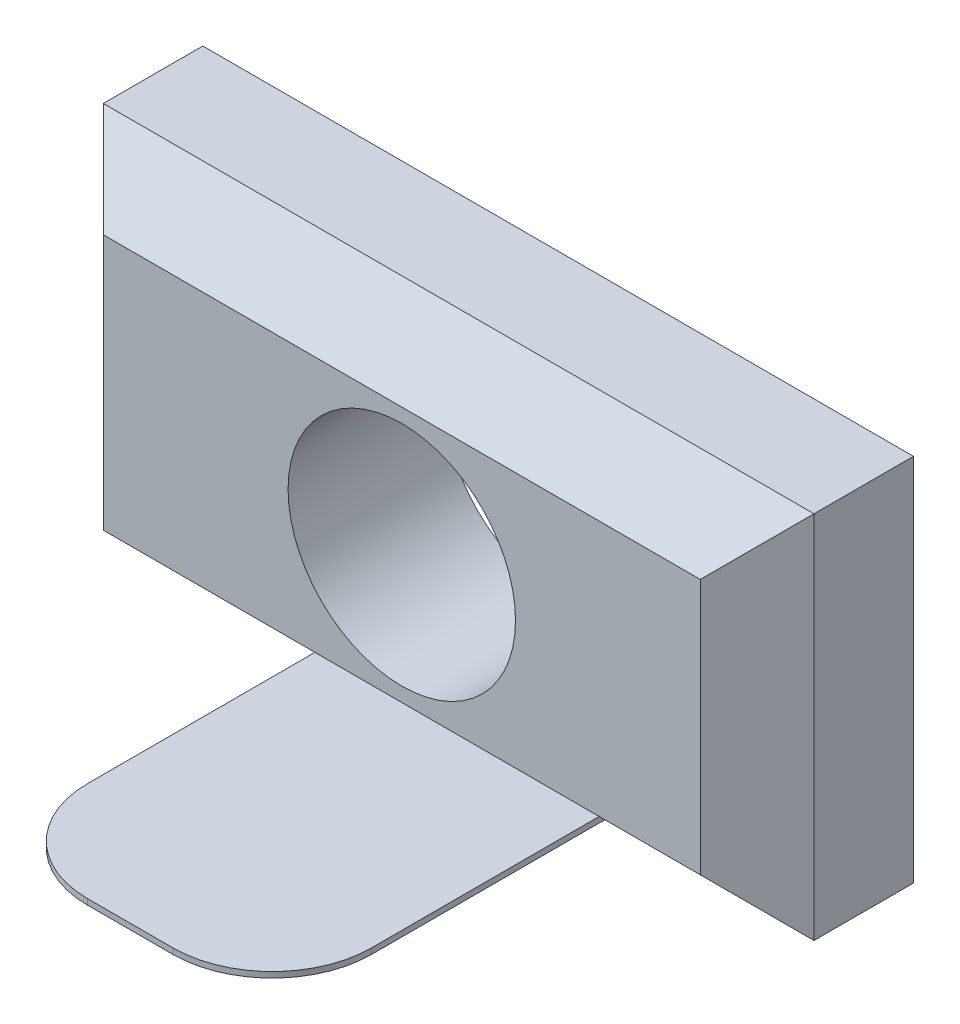
ISO-10303-21;
HEADER;
FILE_DESCRIPTION(('STEP AP214'),'2;1');
FILE_NAME('part.step','',(''),(''),'','','');
FILE_SCHEMA(('AUTOMOTIVE_DESIGN { 1 0 10303 214 1 1 1 1 }'));
ENDSEC;
DATA;
#1=APPLICATION_CONTEXT('core data for automotive mechanical design processes');
#2=APPLICATION_PROTOCOL_DEFINITION('international standard','automotive_design',2000,#1);
#3=PRODUCT_CONTEXT('',#1,'mechanical');
#4=PRODUCT('Part','Part','',(#3));
#5=PRODUCT_RELATED_PRODUCT_CATEGORY('part','',(#4));
#6=PRODUCT_DEFINITION_FORMATION('','',#4);
#7=PRODUCT_DEFINITION_CONTEXT('part definition',#1,'design');
#8=PRODUCT_DEFINITION('design','',#6,#7);
#9=PRODUCT_DEFINITION_SHAPE('','',#8);
#10=(LENGTH_UNIT() NAMED_UNIT(*) SI_UNIT(.MILLI.,.METRE.));
#11=(NAMED_UNIT(*) PLANE_ANGLE_UNIT() SI_UNIT($,.RADIAN.));
#12=(NAMED_UNIT(*) SI_UNIT($,.STERADIAN.) SOLID_ANGLE_UNIT());
#13=UNCERTAINTY_MEASURE_WITH_UNIT(LENGTH_MEASURE(1.E-05),#10,'distance_accuracy_value','');
#14=(GEOMETRIC_REPRESENTATION_CONTEXT(3) GLOBAL_UNCERTAINTY_ASSIGNED_CONTEXT((#13)) GLOBAL_UNIT_ASSIGNED_CONTEXT((#10,
#11,#12)) REPRESENTATION_CONTEXT('',''));
#15=CARTESIAN_POINT('',(0.,0.,0.));
#16=DIRECTION('',(0.,0.,1.));
#17=DIRECTION('',(1.,0.,0.));
#18=AXIS2_PLACEMENT_3D('',#15,#16,#17);
#19=CARTESIAN_POINT('',(-0.056548596713961,-6.5,6.97247170936017));
#20=DIRECTION('',(0.,1.,0.));
#21=DIRECTION('',(0.,0.,1.));
#22=AXIS2_PLACEMENT_3D('',#19,#20,#21);
#23=PLANE('',#22);
#24=DIRECTION('',(0.,0.,-1.));
#25=VECTOR('',#24,1.);
#26=CARTESIAN_POINT('',(4.94345140328603,-6.5,11.5));
#27=LINE('',#26,#25);
#28=CARTESIAN_POINT('',(4.94345140328604,-6.5,3.5));
#29=VERTEX_POINT('',#28);
#30=CARTESIAN_POINT('',(4.94345140328603,-6.5,11.5));
#31=VERTEX_POINT('',#30);
#32=EDGE_CURVE('E148',#29,#31,#27,.F.);
#33=ORIENTED_EDGE('',*,*,#32,.F.);
#34=DIRECTION('',(1.,0.,0.));
#35=VECTOR('',#34,1.);
#36=CARTESIAN_POINT('',(6.25,-6.5,3.5));
#37=LINE('',#36,#35);
#38=CARTESIAN_POINT('',(-5.05654859671396,-6.5,3.5));
#39=VERTEX_POINT('',#38);
#40=EDGE_CURVE('E151',#39,#29,#37,.T.);
#41=ORIENTED_EDGE('',*,*,#40,.F.);
#42=DIRECTION('',(0.,0.,1.));
#43=VECTOR('',#42,1.);
#44=CARTESIAN_POINT('',(-5.05654859671396,-6.5,0.));
#45=LINE('',#44,#43);
#46=CARTESIAN_POINT('',(-5.05654859671396,-6.5,11.5));
#47=VERTEX_POINT('',#46);
#48=EDGE_CURVE('E122',#47,#39,#45,.F.);
#49=ORIENTED_EDGE('',*,*,#48,.F.);
#50=CARTESIAN_POINT('',(-1.55654859671396,-6.5,11.5));
#51=DIRECTION('',(0.,-1.,0.));
#52=DIRECTION('',(0.,0.,-1.));
#53=AXIS2_PLACEMENT_3D('',#50,#51,#52);
#54=CIRCLE('',#53,3.5);
#55=CARTESIAN_POINT('',(-1.55654859671396,-6.5,15.));
#56=VERTEX_POINT('',#55);
#57=EDGE_CURVE('E17',#56,#47,#54,.T.);
#58=ORIENTED_EDGE('',*,*,#57,.F.);
#59=DIRECTION('',(1.,0.,0.));
#60=VECTOR('',#59,1.);
#61=CARTESIAN_POINT('',(-1.55654859671396,-6.5,15.));
#62=LINE('',#61,#60);
#63=CARTESIAN_POINT('',(1.44345140328604,-6.5,15.));
#64=VERTEX_POINT('',#63);
#65=EDGE_CURVE('E107',#64,#56,#62,.F.);
#66=ORIENTED_EDGE('',*,*,#65,.F.);
#67=CARTESIAN_POINT('',(1.44345140328603,-6.5,11.5));
#68=DIRECTION('',(0.,-1.,0.));
#69=DIRECTION('',(0.,0.,-1.));
#70=AXIS2_PLACEMENT_3D('',#67,#68,#69);
#71=CIRCLE('',#70,3.5);
#72=EDGE_CURVE('E129',#31,#64,#71,.T.);
#73=ORIENTED_EDGE('',*,*,#72,.F.);
#74=EDGE_LOOP('',(#33,#41,#49,#58,#66,#73));
#75=FACE_BOUND('',#74,.T.);
#76=ADVANCED_FACE('F14',(#75),#23,.T.);
#77=CARTESIAN_POINT('',(-11.5,-3.25,4.5));
#78=DIRECTION('',(-0.707106781186547,0.,0.707106781186548));
#79=DIRECTION('',(0.707106781186548,0.,0.707106781186547));
#80=AXIS2_PLACEMENT_3D('',#77,#78,#79);
#81=PLANE('',#80);
#82=DIRECTION('',(0.577350269189627,-0.577350269189626,0.577350269189626));
#83=VECTOR('',#82,1.);
#84=CARTESIAN_POINT('',(-12.5,6.5,3.5));
#85=LINE('',#84,#83);
#86=CARTESIAN_POINT('',(-12.5,6.5,3.5));
#87=VERTEX_POINT('',#86);
#88=CARTESIAN_POINT('',(-10.5,4.5,5.5));
#89=VERTEX_POINT('',#88);
#90=EDGE_CURVE('E211',#87,#89,#85,.T.);
#91=ORIENTED_EDGE('',*,*,#90,.F.);
#92=DIRECTION('',(0.,1.,0.));
#93=VECTOR('',#92,1.);
#94=CARTESIAN_POINT('',(-12.5,-6.5,3.5));
#95=LINE('',#94,#93);
#96=CARTESIAN_POINT('',(-12.5,-6.5,3.5));
#97=VERTEX_POINT('',#96);
#98=EDGE_CURVE('E176',#97,#87,#95,.T.);
#99=ORIENTED_EDGE('',*,*,#98,.F.);
#100=DIRECTION('',(-0.577350269189626,-0.577350269189626,-0.577350269189625));
#101=VECTOR('',#100,1.);
#102=CARTESIAN_POINT('',(-10.5,-4.5,5.5));
#103=LINE('',#102,#101);
#104=CARTESIAN_POINT('',(-10.5,-4.5,5.5));
#105=VERTEX_POINT('',#104);
#106=EDGE_CURVE('E160',#105,#97,#103,.T.);
#107=ORIENTED_EDGE('',*,*,#106,.F.);
#108=DIRECTION('',(0.,1.,0.));
#109=VECTOR('',#108,1.);
#110=CARTESIAN_POINT('',(-10.5,0.,5.5));
#111=LINE('',#110,#109);
#112=EDGE_CURVE('E201',#89,#105,#111,.F.);
#113=ORIENTED_EDGE('',*,*,#112,.F.);
#114=EDGE_LOOP('',(#91,#99,#107,#113));
#115=FACE_BOUND('',#114,.T.);
#116=ADVANCED_FACE('F314',(#115),#81,.T.);
#117=CARTESIAN_POINT('',(-1.55654859671396,-6.5,11.5));
#118=DIRECTION('',(0.,-1.,0.));
#119=DIRECTION('',(0.,0.,-1.));
#120=AXIS2_PLACEMENT_3D('',#117,#118,#119);
#121=CYLINDRICAL_SURFACE('',#120,3.5);
#122=ORIENTED_EDGE('',*,*,#57,.T.);
#123=DIRECTION('',(0.,1.,0.));
#124=VECTOR('',#123,1.);
#125=CARTESIAN_POINT('',(-5.05654859671396,-6.5,11.5));
#126=LINE('',#125,#124);
#127=CARTESIAN_POINT('',(-5.05654859671396,-6.7,11.5));
#128=VERTEX_POINT('',#127);
#129=EDGE_CURVE('E219',#128,#47,#126,.T.);
#130=ORIENTED_EDGE('',*,*,#129,.F.);
#131=CARTESIAN_POINT('',(-1.55654859671396,-6.7,11.5));
#132=DIRECTION('',(0.,-1.,0.));
#133=DIRECTION('',(0.,0.,-1.));
#134=AXIS2_PLACEMENT_3D('',#131,#132,#133);
#135=CIRCLE('',#134,3.5);
#136=CARTESIAN_POINT('',(-1.55654859671396,-6.7,15.));
#137=VERTEX_POINT('',#136);
#138=EDGE_CURVE('E128',#128,#137,#135,.F.);
#139=ORIENTED_EDGE('',*,*,#138,.T.);
#140=DIRECTION('',(0.,1.,0.));
#141=VECTOR('',#140,1.);
#142=CARTESIAN_POINT('',(-1.55654859671396,-6.5,15.));
#143=LINE('',#142,#141);
#144=EDGE_CURVE('E112',#56,#137,#143,.F.);
#145=ORIENTED_EDGE('',*,*,#144,.F.);
#146=EDGE_LOOP('',(#122,#130,#139,#145));
#147=FACE_BOUND('',#146,.T.);
#148=ADVANCED_FACE('F127',(#147),#121,.T.);
#149=CARTESIAN_POINT('',(-1.55654859671396,-6.5,15.));
#150=DIRECTION('',(0.,0.,1.));
#151=DIRECTION('',(1.,0.,0.));
#152=AXIS2_PLACEMENT_3D('',#149,#150,#151);
#153=PLANE('',#152);
#154=ORIENTED_EDGE('',*,*,#65,.T.);
#155=ORIENTED_EDGE('',*,*,#144,.T.);
#156=DIRECTION('',(1.,0.,0.));
#157=VECTOR('',#156,1.);
#158=CARTESIAN_POINT('',(-0.056548596713961,-6.7,15.));
#159=LINE('',#158,#157);
#160=CARTESIAN_POINT('',(1.44345140328603,-6.7,15.));
#161=VERTEX_POINT('',#160);
#162=EDGE_CURVE('E193',#137,#161,#159,.T.);
#163=ORIENTED_EDGE('',*,*,#162,.T.);
#164=DIRECTION('',(0.,-1.,0.));
#165=VECTOR('',#164,1.);
#166=CARTESIAN_POINT('',(1.44345140328604,-6.5,15.));
#167=LINE('',#166,#165);
#168=EDGE_CURVE('E114',#64,#161,#167,.T.);
#169=ORIENTED_EDGE('',*,*,#168,.F.);
#170=EDGE_LOOP('',(#154,#155,#163,#169));
#171=FACE_BOUND('',#170,.T.);
#172=ADVANCED_FACE('F109',(#171),#153,.T.);
#173=CARTESIAN_POINT('',(1.44345140328603,-6.5,11.5));
#174=DIRECTION('',(0.,-1.,0.));
#175=DIRECTION('',(0.,0.,-1.));
#176=AXIS2_PLACEMENT_3D('',#173,#174,#175);
#177=CYLINDRICAL_SURFACE('',#176,3.5);
#178=ORIENTED_EDGE('',*,*,#72,.T.);
#179=ORIENTED_EDGE('',*,*,#168,.T.);
#180=CARTESIAN_POINT('',(1.44345140328603,-6.7,11.5));
#181=DIRECTION('',(0.,-1.,0.));
#182=DIRECTION('',(0.,0.,-1.));
#183=AXIS2_PLACEMENT_3D('',#180,#181,#182);
#184=CIRCLE('',#183,3.5);
#185=CARTESIAN_POINT('',(4.94345140328603,-6.7,11.5));
#186=VERTEX_POINT('',#185);
#187=EDGE_CURVE('E189',#161,#186,#184,.F.);
#188=ORIENTED_EDGE('',*,*,#187,.T.);
#189=DIRECTION('',(0.,1.,0.));
#190=VECTOR('',#189,1.);
#191=CARTESIAN_POINT('',(4.94345140328603,-6.5,11.5));
#192=LINE('',#191,#190);
#193=EDGE_CURVE('E150',#31,#186,#192,.F.);
#194=ORIENTED_EDGE('',*,*,#193,.F.);
#195=EDGE_LOOP('',(#178,#179,#188,#194));
#196=FACE_BOUND('',#195,.T.);
#197=ADVANCED_FACE('F335',(#196),#177,.T.);
#198=CARTESIAN_POINT('',(-5.05654859671396,-6.5,0.));
#199=DIRECTION('',(-1.,0.,0.));
#200=DIRECTION('',(0.,0.,1.));
#201=AXIS2_PLACEMENT_3D('',#198,#199,#200);
#202=PLANE('',#201);
#203=DIRECTION('',(0.,0.,1.));
#204=VECTOR('',#203,1.);
#205=CARTESIAN_POINT('',(-5.05654859671396,-6.7,6.97247170936017));
#206=LINE('',#205,#204);
#207=CARTESIAN_POINT('',(-5.05654859671396,-6.7,0.));
#208=VERTEX_POINT('',#207);
#209=EDGE_CURVE('E156',#208,#128,#206,.T.);
#210=ORIENTED_EDGE('',*,*,#209,.T.);
#211=ORIENTED_EDGE('',*,*,#129,.T.);
#212=ORIENTED_EDGE('',*,*,#48,.T.);
#213=DIRECTION('',(0.,0.,-1.));
#214=VECTOR('',#213,1.);
#215=CARTESIAN_POINT('',(-5.05654859671396,-6.5,0.));
#216=LINE('',#215,#214);
#217=CARTESIAN_POINT('',(-5.05654859671396,-6.5,0.));
#218=VERTEX_POINT('',#217);
#219=EDGE_CURVE('E163',#218,#39,#216,.F.);
#220=ORIENTED_EDGE('',*,*,#219,.F.);
#221=DIRECTION('',(0.,1.,0.));
#222=VECTOR('',#221,1.);
#223=CARTESIAN_POINT('',(-5.05654859671396,-6.5,0.));
#224=LINE('',#223,#222);
#225=EDGE_CURVE('E170',#218,#208,#224,.F.);
#226=ORIENTED_EDGE('',*,*,#225,.T.);
#227=EDGE_LOOP('',(#210,#211,#212,#220,#226));
#228=FACE_BOUND('',#227,.T.);
#229=ADVANCED_FACE('F265',(#228),#202,.T.);
#230=CARTESIAN_POINT('',(6.25,-5.5,4.5));
#231=DIRECTION('',(0.,-0.707106781186547,0.707106781186548));
#232=DIRECTION('',(0.,-0.707106781186548,-0.707106781186547));
#233=AXIS2_PLACEMENT_3D('',#230,#231,#232);
#234=PLANE('',#233);
#235=DIRECTION('',(1.,0.,0.));
#236=VECTOR('',#235,1.);
#237=CARTESIAN_POINT('',(12.5,-6.5,3.5));
#238=LINE('',#237,#236);
#239=EDGE_CURVE('E173',#39,#97,#238,.F.);
#240=ORIENTED_EDGE('',*,*,#239,.F.);
#241=ORIENTED_EDGE('',*,*,#40,.T.);
#242=DIRECTION('',(1.,0.,0.));
#243=VECTOR('',#242,1.);
#244=CARTESIAN_POINT('',(12.5,-6.5,3.5));
#245=LINE('',#244,#243);
#246=CARTESIAN_POINT('',(12.5,-6.5,3.5));
#247=VERTEX_POINT('',#246);
#248=EDGE_CURVE('E138',#247,#29,#245,.F.);
#249=ORIENTED_EDGE('',*,*,#248,.F.);
#250=DIRECTION('',(0.577350269189626,-0.577350269189626,-0.577350269189626));
#251=VECTOR('',#250,1.);
#252=CARTESIAN_POINT('',(10.5,-4.5,5.5));
#253=LINE('',#252,#251);
#254=CARTESIAN_POINT('',(10.5,-4.5,5.5));
#255=VERTEX_POINT('',#254);
#256=EDGE_CURVE('E215',#255,#247,#253,.T.);
#257=ORIENTED_EDGE('',*,*,#256,.F.);
#258=DIRECTION('',(1.,0.,0.));
#259=VECTOR('',#258,1.);
#260=CARTESIAN_POINT('',(0.,-4.5,5.5));
#261=LINE('',#260,#259);
#262=EDGE_CURVE('E209',#105,#255,#261,.T.);
#263=ORIENTED_EDGE('',*,*,#262,.F.);
#264=ORIENTED_EDGE('',*,*,#106,.T.);
#265=EDGE_LOOP('',(#240,#241,#249,#257,#263,#264));
#266=FACE_BOUND('',#265,.T.);
#267=ADVANCED_FACE('F316',(#266),#234,.T.);
#268=CARTESIAN_POINT('',(4.94345140328603,-6.5,11.5));
#269=DIRECTION('',(1.,0.,0.));
#270=DIRECTION('',(0.,0.,-1.));
#271=AXIS2_PLACEMENT_3D('',#268,#269,#270);
#272=PLANE('',#271);
#273=DIRECTION('',(0.,1.,0.));
#274=VECTOR('',#273,1.);
#275=CARTESIAN_POINT('',(4.94345140328603,-6.5,0.));
#276=LINE('',#275,#274);
#277=CARTESIAN_POINT('',(4.94345140328604,-6.7,0.));
#278=VERTEX_POINT('',#277);
#279=CARTESIAN_POINT('',(4.94345140328603,-6.5,0.));
#280=VERTEX_POINT('',#279);
#281=EDGE_CURVE('E217',#278,#280,#276,.T.);
#282=ORIENTED_EDGE('',*,*,#281,.T.);
#283=DIRECTION('',(0.,0.,-1.));
#284=VECTOR('',#283,1.);
#285=CARTESIAN_POINT('',(4.94345140328604,-6.5,0.));
#286=LINE('',#285,#284);
#287=EDGE_CURVE('E134',#29,#280,#286,.T.);
#288=ORIENTED_EDGE('',*,*,#287,.F.);
#289=ORIENTED_EDGE('',*,*,#32,.T.);
#290=ORIENTED_EDGE('',*,*,#193,.T.);
#291=DIRECTION('',(0.,0.,1.));
#292=VECTOR('',#291,1.);
#293=CARTESIAN_POINT('',(4.94345140328603,-6.7,6.97247170936017));
#294=LINE('',#293,#292);
#295=EDGE_CURVE('E192',#186,#278,#294,.F.);
#296=ORIENTED_EDGE('',*,*,#295,.T.);
#297=EDGE_LOOP('',(#282,#288,#289,#290,#296));
#298=FACE_BOUND('',#297,.T.);
#299=ADVANCED_FACE('F233',(#298),#272,.T.);
#300=CARTESIAN_POINT('',(11.5,3.25,4.5));
#301=DIRECTION('',(0.707106781186548,0.,0.707106781186547));
#302=DIRECTION('',(0.707106781186547,0.,-0.707106781186548));
#303=AXIS2_PLACEMENT_3D('',#300,#301,#302);
#304=PLANE('',#303);
#305=DIRECTION('',(0.,1.,0.));
#306=VECTOR('',#305,1.);
#307=CARTESIAN_POINT('',(12.5,6.5,3.5));
#308=LINE('',#307,#306);
#309=CARTESIAN_POINT('',(12.5,6.5,3.5));
#310=VERTEX_POINT('',#309);
#311=EDGE_CURVE('E137',#310,#247,#308,.F.);
#312=ORIENTED_EDGE('',*,*,#311,.F.);
#313=DIRECTION('',(0.577350269189625,0.577350269189626,-0.577350269189626));
#314=VECTOR('',#313,1.);
#315=CARTESIAN_POINT('',(10.5,4.5,5.5));
#316=LINE('',#315,#314);
#317=CARTESIAN_POINT('',(10.5,4.5,5.5));
#318=VERTEX_POINT('',#317);
#319=EDGE_CURVE('E213',#318,#310,#316,.T.);
#320=ORIENTED_EDGE('',*,*,#319,.F.);
#321=DIRECTION('',(0.,1.,0.));
#322=VECTOR('',#321,1.);
#323=CARTESIAN_POINT('',(10.5,0.,5.5));
#324=LINE('',#323,#322);
#325=EDGE_CURVE('E207',#255,#318,#324,.T.);
#326=ORIENTED_EDGE('',*,*,#325,.F.);
#327=ORIENTED_EDGE('',*,*,#256,.T.);
#328=EDGE_LOOP('',(#312,#320,#326,#327));
#329=FACE_BOUND('',#328,.T.);
#330=ADVANCED_FACE('F320',(#329),#304,.T.);
#331=CARTESIAN_POINT('',(-6.25,5.5,4.5));
#332=DIRECTION('',(0.,0.707106781186548,0.707106781186548));
#333=DIRECTION('',(0.,-0.707106781186548,0.707106781186548));
#334=AXIS2_PLACEMENT_3D('',#331,#332,#333);
#335=PLANE('',#334);
#336=DIRECTION('',(1.,0.,0.));
#337=VECTOR('',#336,1.);
#338=CARTESIAN_POINT('',(-12.5,6.5,3.5));
#339=LINE('',#338,#337);
#340=EDGE_CURVE('E254',#87,#310,#339,.T.);
#341=ORIENTED_EDGE('',*,*,#340,.F.);
#342=ORIENTED_EDGE('',*,*,#90,.T.);
#343=DIRECTION('',(1.,0.,0.));
#344=VECTOR('',#343,1.);
#345=CARTESIAN_POINT('',(0.,4.5,5.5));
#346=LINE('',#345,#344);
#347=EDGE_CURVE('E204',#318,#89,#346,.F.);
#348=ORIENTED_EDGE('',*,*,#347,.F.);
#349=ORIENTED_EDGE('',*,*,#319,.T.);
#350=EDGE_LOOP('',(#341,#342,#348,#349));
#351=FACE_BOUND('',#350,.T.);
#352=ADVANCED_FACE('F305',(#351),#335,.T.);
#353=CARTESIAN_POINT('',(0.,0.,5.5));
#354=DIRECTION('',(0.,0.,1.));
#355=DIRECTION('',(1.,0.,0.));
#356=AXIS2_PLACEMENT_3D('',#353,#354,#355);
#357=PLANE('',#356);
#358=CARTESIAN_POINT('',(0.,0.,5.5));
#359=DIRECTION('',(0.,0.,1.));
#360=DIRECTION('',(1.,0.,0.));
#361=AXIS2_PLACEMENT_3D('',#358,#359,#360);
#362=CIRCLE('',#361,4.);
#363=CARTESIAN_POINT('',(4.,0.,5.5));
#364=VERTEX_POINT('',#363);
#365=EDGE_CURVE('E185',#364,#364,#362,.F.);
#366=ORIENTED_EDGE('',*,*,#365,.T.);
#367=EDGE_LOOP('',(#366));
#368=FACE_BOUND('',#367,.T.);
#369=ORIENTED_EDGE('',*,*,#347,.T.);
#370=ORIENTED_EDGE('',*,*,#112,.T.);
#371=ORIENTED_EDGE('',*,*,#262,.T.);
#372=ORIENTED_EDGE('',*,*,#325,.T.);
#373=EDGE_LOOP('',(#369,#370,#371,#372));
#374=FACE_BOUND('',#373,.T.);
#375=ADVANCED_FACE('F302',(#368,#374),#357,.T.);
#376=CARTESIAN_POINT('',(-12.5,-6.5,0.));
#377=DIRECTION('',(-1.,0.,0.));
#378=DIRECTION('',(0.,0.,1.));
#379=AXIS2_PLACEMENT_3D('',#376,#377,#378);
#380=PLANE('',#379);
#381=DIRECTION('',(0.,1.,0.));
#382=VECTOR('',#381,1.);
#383=CARTESIAN_POINT('',(-12.5,0.,0.));
#384=LINE('',#383,#382);
#385=CARTESIAN_POINT('',(-12.5,6.5,0.));
#386=VERTEX_POINT('',#385);
#387=CARTESIAN_POINT('',(-12.5,-6.5,0.));
#388=VERTEX_POINT('',#387);
#389=EDGE_CURVE('E182',#386,#388,#384,.F.);
#390=ORIENTED_EDGE('',*,*,#389,.T.);
#391=DIRECTION('',(0.,0.,-1.));
#392=VECTOR('',#391,1.);
#393=CARTESIAN_POINT('',(-12.5,-6.5,0.));
#394=LINE('',#393,#392);
#395=EDGE_CURVE('E166',#97,#388,#394,.T.);
#396=ORIENTED_EDGE('',*,*,#395,.F.);
#397=ORIENTED_EDGE('',*,*,#98,.T.);
#398=DIRECTION('',(0.,0.,1.));
#399=VECTOR('',#398,1.);
#400=CARTESIAN_POINT('',(-12.5,6.5,0.));
#401=LINE('',#400,#399);
#402=EDGE_CURVE('E188',#386,#87,#401,.T.);
#403=ORIENTED_EDGE('',*,*,#402,.F.);
#404=EDGE_LOOP('',(#390,#396,#397,#403));
#405=FACE_BOUND('',#404,.T.);
#406=ADVANCED_FACE('F276',(#405),#380,.T.);
#407=CARTESIAN_POINT('',(12.5,-6.5,0.));
#408=DIRECTION('',(0.,-1.,0.));
#409=DIRECTION('',(0.,0.,-1.));
#410=AXIS2_PLACEMENT_3D('',#407,#408,#409);
#411=PLANE('',#410);
#412=DIRECTION('',(1.,0.,0.));
#413=VECTOR('',#412,1.);
#414=CARTESIAN_POINT('',(0.,-6.5,0.));
#415=LINE('',#414,#413);
#416=EDGE_CURVE('E179',#388,#218,#415,.T.);
#417=ORIENTED_EDGE('',*,*,#416,.T.);
#418=ORIENTED_EDGE('',*,*,#219,.T.);
#419=ORIENTED_EDGE('',*,*,#239,.T.);
#420=ORIENTED_EDGE('',*,*,#395,.T.);
#421=EDGE_LOOP('',(#417,#418,#419,#420));
#422=FACE_BOUND('',#421,.T.);
#423=ADVANCED_FACE('F272',(#422),#411,.T.);
#424=CARTESIAN_POINT('',(-0.056548596713961,-6.7,6.97247170936017));
#425=DIRECTION('',(0.,1.,0.));
#426=DIRECTION('',(0.,0.,1.));
#427=AXIS2_PLACEMENT_3D('',#424,#425,#426);
#428=PLANE('',#427);
#429=DIRECTION('',(1.,0.,0.));
#430=VECTOR('',#429,1.);
#431=CARTESIAN_POINT('',(0.,-6.7,0.));
#432=LINE('',#431,#430);
#433=EDGE_CURVE('E145',#208,#278,#432,.T.);
#434=ORIENTED_EDGE('',*,*,#433,.T.);
#435=ORIENTED_EDGE('',*,*,#295,.F.);
#436=ORIENTED_EDGE('',*,*,#187,.F.);
#437=ORIENTED_EDGE('',*,*,#162,.F.);
#438=ORIENTED_EDGE('',*,*,#138,.F.);
#439=ORIENTED_EDGE('',*,*,#209,.F.);
#440=EDGE_LOOP('',(#434,#435,#436,#437,#438,#439));
#441=FACE_BOUND('',#440,.T.);
#442=ADVANCED_FACE('F268',(#441),#428,.F.);
#443=CARTESIAN_POINT('',(12.5,-6.5,0.));
#444=DIRECTION('',(0.,-1.,0.));
#445=DIRECTION('',(0.,0.,-1.));
#446=AXIS2_PLACEMENT_3D('',#443,#444,#445);
#447=PLANE('',#446);
#448=DIRECTION('',(1.,0.,0.));
#449=VECTOR('',#448,1.);
#450=CARTESIAN_POINT('',(0.,-6.5,0.));
#451=LINE('',#450,#449);
#452=CARTESIAN_POINT('',(12.5,-6.5,0.));
#453=VERTEX_POINT('',#452);
#454=EDGE_CURVE('E141',#280,#453,#451,.T.);
#455=ORIENTED_EDGE('',*,*,#454,.T.);
#456=DIRECTION('',(0.,0.,-1.));
#457=VECTOR('',#456,1.);
#458=CARTESIAN_POINT('',(12.5,-6.5,0.));
#459=LINE('',#458,#457);
#460=EDGE_CURVE('E256',#247,#453,#459,.T.);
#461=ORIENTED_EDGE('',*,*,#460,.F.);
#462=ORIENTED_EDGE('',*,*,#248,.T.);
#463=ORIENTED_EDGE('',*,*,#287,.T.);
#464=EDGE_LOOP('',(#455,#461,#462,#463));
#465=FACE_BOUND('',#464,.T.);
#466=ADVANCED_FACE('F239',(#465),#447,.T.);
#467=CARTESIAN_POINT('',(12.5,6.5,0.));
#468=DIRECTION('',(1.,0.,0.));
#469=DIRECTION('',(0.,0.,-1.));
#470=AXIS2_PLACEMENT_3D('',#467,#468,#469);
#471=PLANE('',#470);
#472=DIRECTION('',(0.,1.,0.));
#473=VECTOR('',#472,1.);
#474=CARTESIAN_POINT('',(12.5,0.,0.));
#475=LINE('',#474,#473);
#476=CARTESIAN_POINT('',(12.5,6.5,0.));
#477=VERTEX_POINT('',#476);
#478=EDGE_CURVE('E144',#453,#477,#475,.T.);
#479=ORIENTED_EDGE('',*,*,#478,.T.);
#480=DIRECTION('',(0.,0.,1.));
#481=VECTOR('',#480,1.);
#482=CARTESIAN_POINT('',(12.5,6.5,0.));
#483=LINE('',#482,#481);
#484=EDGE_CURVE('E32',#310,#477,#483,.F.);
#485=ORIENTED_EDGE('',*,*,#484,.F.);
#486=ORIENTED_EDGE('',*,*,#311,.T.);
#487=ORIENTED_EDGE('',*,*,#460,.T.);
#488=EDGE_LOOP('',(#479,#485,#486,#487));
#489=FACE_BOUND('',#488,.T.);
#490=ADVANCED_FACE('F283',(#489),#471,.T.);
#491=CARTESIAN_POINT('',(-12.5,6.5,0.));
#492=DIRECTION('',(0.,1.,0.));
#493=DIRECTION('',(0.,0.,1.));
#494=AXIS2_PLACEMENT_3D('',#491,#492,#493);
#495=PLANE('',#494);
#496=DIRECTION('',(1.,0.,0.));
#497=VECTOR('',#496,1.);
#498=CARTESIAN_POINT('',(0.,6.5,0.));
#499=LINE('',#498,#497);
#500=EDGE_CURVE('E23',#477,#386,#499,.F.);
#501=ORIENTED_EDGE('',*,*,#500,.T.);
#502=ORIENTED_EDGE('',*,*,#402,.T.);
#503=ORIENTED_EDGE('',*,*,#340,.T.);
#504=ORIENTED_EDGE('',*,*,#484,.T.);
#505=EDGE_LOOP('',(#501,#502,#503,#504));
#506=FACE_BOUND('',#505,.T.);
#507=ADVANCED_FACE('F280',(#506),#495,.T.);
#508=CARTESIAN_POINT('',(0.,0.,0.));
#509=DIRECTION('',(0.,0.,1.));
#510=DIRECTION('',(1.,0.,0.));
#511=AXIS2_PLACEMENT_3D('',#508,#509,#510);
#512=CYLINDRICAL_SURFACE('',#511,4.);
#513=CARTESIAN_POINT('',(0.,0.,0.));
#514=DIRECTION('',(0.,0.,1.));
#515=DIRECTION('',(1.,0.,0.));
#516=AXIS2_PLACEMENT_3D('',#513,#514,#515);
#517=CIRCLE('',#516,4.);
#518=CARTESIAN_POINT('',(4.,0.,0.));
#519=VERTEX_POINT('',#518);
#520=EDGE_CURVE('E9',#519,#519,#517,.F.);
#521=ORIENTED_EDGE('',*,*,#520,.T.);
#522=EDGE_LOOP('',(#521));
#523=FACE_BOUND('',#522,.T.);
#524=ORIENTED_EDGE('',*,*,#365,.F.);
#525=EDGE_LOOP('',(#524));
#526=FACE_BOUND('',#525,.T.);
#527=ADVANCED_FACE('F282',(#523,#526),#512,.F.);
#528=CARTESIAN_POINT('',(0.,0.,0.));
#529=DIRECTION('',(0.,0.,1.));
#530=DIRECTION('',(1.,0.,0.));
#531=AXIS2_PLACEMENT_3D('',#528,#529,#530);
#532=PLANE('',#531);
#533=ORIENTED_EDGE('',*,*,#520,.F.);
#534=EDGE_LOOP('',(#533));
#535=FACE_BOUND('',#534,.T.);
#536=ORIENTED_EDGE('',*,*,#478,.F.);
#537=ORIENTED_EDGE('',*,*,#454,.F.);
#538=ORIENTED_EDGE('',*,*,#281,.F.);
#539=ORIENTED_EDGE('',*,*,#433,.F.);
#540=ORIENTED_EDGE('',*,*,#225,.F.);
#541=ORIENTED_EDGE('',*,*,#416,.F.);
#542=ORIENTED_EDGE('',*,*,#389,.F.);
#543=ORIENTED_EDGE('',*,*,#500,.F.);
#544=EDGE_LOOP('',(#536,#537,#538,#539,#540,#541,#542,#543));
#545=FACE_BOUND('',#544,.T.);
#546=ADVANCED_FACE('F243',(#535,#545),#532,.F.);
#547=CLOSED_SHELL('',(#76,#116,#148,#172,#197,#229,#267,#299,#330,#352,#375,#406,#423,#442,#466,
#490,#507,#527,#546));
#548=MANIFOLD_SOLID_BREP('B1',#547);
#549=ADVANCED_BREP_SHAPE_REPRESENTATION('',(#18,#548),#14);
#550=SHAPE_DEFINITION_REPRESENTATION(#9,#549);
ENDSEC;
END-ISO-10303-21;
